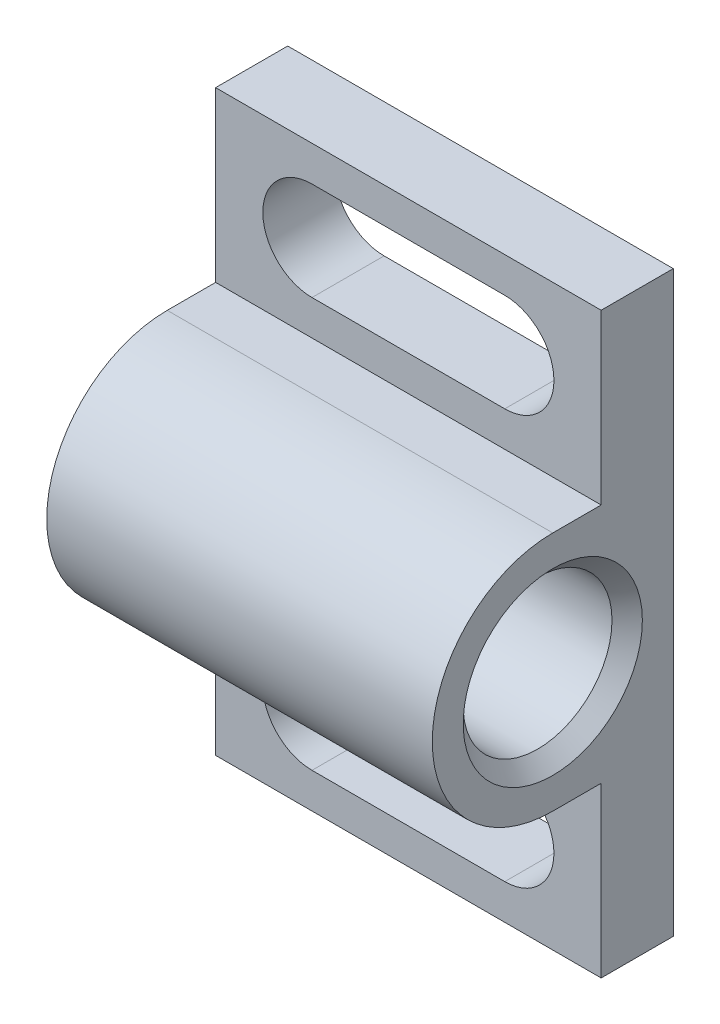
ISO-10303-21;
HEADER;
FILE_DESCRIPTION(('STEP AP214'),'2;1');
FILE_NAME('part.step','',(''),(''),'','','');
FILE_SCHEMA(('AUTOMOTIVE_DESIGN { 1 0 10303 214 1 1 1 1 }'));
ENDSEC;
DATA;
#1=APPLICATION_CONTEXT('core data for automotive mechanical design processes');
#2=APPLICATION_PROTOCOL_DEFINITION('international standard','automotive_design',2000,#1);
#3=PRODUCT_CONTEXT('',#1,'mechanical');
#4=PRODUCT('Part','Part','',(#3));
#5=PRODUCT_RELATED_PRODUCT_CATEGORY('part','',(#4));
#6=PRODUCT_DEFINITION_FORMATION('','',#4);
#7=PRODUCT_DEFINITION_CONTEXT('part definition',#1,'design');
#8=PRODUCT_DEFINITION('design','',#6,#7);
#9=PRODUCT_DEFINITION_SHAPE('','',#8);
#10=(LENGTH_UNIT() NAMED_UNIT(*) SI_UNIT(.MILLI.,.METRE.));
#11=(NAMED_UNIT(*) PLANE_ANGLE_UNIT() SI_UNIT($,.RADIAN.));
#12=(NAMED_UNIT(*) SI_UNIT($,.STERADIAN.) SOLID_ANGLE_UNIT());
#13=UNCERTAINTY_MEASURE_WITH_UNIT(LENGTH_MEASURE(1.E-05),#10,'distance_accuracy_value','');
#14=(GEOMETRIC_REPRESENTATION_CONTEXT(3) GLOBAL_UNCERTAINTY_ASSIGNED_CONTEXT((#13)) GLOBAL_UNIT_ASSIGNED_CONTEXT((#10,
#11,#12)) REPRESENTATION_CONTEXT('',''));
#15=CARTESIAN_POINT('',(0.,0.,0.));
#16=DIRECTION('',(0.,0.,1.));
#17=DIRECTION('',(1.,0.,0.));
#18=AXIS2_PLACEMENT_3D('',#15,#16,#17);
#19=CARTESIAN_POINT('',(-25.4,-19.05,0.));
#20=DIRECTION('',(0.,0.,-1.));
#21=DIRECTION('',(0.,1.,0.));
#22=AXIS2_PLACEMENT_3D('',#19,#20,#21);
#23=PLANE('',#22);
#24=DIRECTION('',(0.,1.,0.));
#25=VECTOR('',#24,1.);
#26=CARTESIAN_POINT('',(0.,-19.05,0.));
#27=LINE('',#26,#25);
#28=CARTESIAN_POINT('',(0.,-19.05,0.));
#29=VERTEX_POINT('',#28);
#30=CARTESIAN_POINT('',(0.,19.05,0.));
#31=VERTEX_POINT('',#30);
#32=EDGE_CURVE('E261',#29,#31,#27,.T.);
#33=ORIENTED_EDGE('',*,*,#32,.F.);
#34=DIRECTION('',(1.,0.,0.));
#35=VECTOR('',#34,1.);
#36=CARTESIAN_POINT('',(-25.4,-19.05,0.));
#37=LINE('',#36,#35);
#38=CARTESIAN_POINT('',(-25.4,-19.05,0.));
#39=VERTEX_POINT('',#38);
#40=EDGE_CURVE('E41',#39,#29,#37,.T.);
#41=ORIENTED_EDGE('',*,*,#40,.F.);
#42=DIRECTION('',(0.,1.,0.));
#43=VECTOR('',#42,1.);
#44=CARTESIAN_POINT('',(-25.4,-19.05,0.));
#45=LINE('',#44,#43);
#46=CARTESIAN_POINT('',(-25.4,19.05,0.));
#47=VERTEX_POINT('',#46);
#48=EDGE_CURVE('E237',#39,#47,#45,.T.);
#49=ORIENTED_EDGE('',*,*,#48,.T.);
#50=DIRECTION('',(1.,0.,0.));
#51=VECTOR('',#50,1.);
#52=CARTESIAN_POINT('',(-25.4,19.05,0.));
#53=LINE('',#52,#51);
#54=EDGE_CURVE('E289',#47,#31,#53,.T.);
#55=ORIENTED_EDGE('',*,*,#54,.T.);
#56=EDGE_LOOP('',(#33,#41,#49,#55));
#57=FACE_BOUND('',#56,.T.);
#58=DIRECTION('',(-1.,0.,0.));
#59=VECTOR('',#58,1.);
#60=CARTESIAN_POINT('',(-19.05,16.7259,0.));
#61=LINE('',#60,#59);
#62=CARTESIAN_POINT('',(-6.35,16.7259,0.));
#63=VERTEX_POINT('',#62);
#64=CARTESIAN_POINT('',(-19.05,16.7259,0.));
#65=VERTEX_POINT('',#64);
#66=EDGE_CURVE('E203',#63,#65,#61,.T.);
#67=ORIENTED_EDGE('',*,*,#66,.T.);
#68=CARTESIAN_POINT('',(-19.05,13.4874,0.));
#69=DIRECTION('',(0.,0.,1.));
#70=DIRECTION('',(1.,0.,0.));
#71=AXIS2_PLACEMENT_3D('',#68,#69,#70);
#72=CIRCLE('',#71,3.2385);
#73=CARTESIAN_POINT('',(-19.05,10.2489,0.));
#74=VERTEX_POINT('',#73);
#75=EDGE_CURVE('E194',#65,#74,#72,.T.);
#76=ORIENTED_EDGE('',*,*,#75,.T.);
#77=DIRECTION('',(1.,0.,0.));
#78=VECTOR('',#77,1.);
#79=CARTESIAN_POINT('',(-19.05,10.2489,0.));
#80=LINE('',#79,#78);
#81=CARTESIAN_POINT('',(-6.35000000000001,10.2489,0.));
#82=VERTEX_POINT('',#81);
#83=EDGE_CURVE('E197',#74,#82,#80,.T.);
#84=ORIENTED_EDGE('',*,*,#83,.T.);
#85=CARTESIAN_POINT('',(-6.35,13.4874,0.));
#86=DIRECTION('',(0.,0.,1.));
#87=DIRECTION('',(1.,0.,0.));
#88=AXIS2_PLACEMENT_3D('',#85,#86,#87);
#89=CIRCLE('',#88,3.2385);
#90=EDGE_CURVE('E200',#82,#63,#89,.T.);
#91=ORIENTED_EDGE('',*,*,#90,.T.);
#92=EDGE_LOOP('',(#67,#76,#84,#91));
#93=FACE_BOUND('',#92,.T.);
#94=DIRECTION('',(-1.,0.,0.));
#95=VECTOR('',#94,1.);
#96=CARTESIAN_POINT('',(-19.05,-10.2489,0.));
#97=LINE('',#96,#95);
#98=CARTESIAN_POINT('',(-6.35,-10.2489,0.));
#99=VERTEX_POINT('',#98);
#100=CARTESIAN_POINT('',(-19.05,-10.2489,0.));
#101=VERTEX_POINT('',#100);
#102=EDGE_CURVE('E159',#99,#101,#97,.T.);
#103=ORIENTED_EDGE('',*,*,#102,.T.);
#104=CARTESIAN_POINT('',(-19.05,-13.4874,0.));
#105=DIRECTION('',(0.,0.,1.));
#106=DIRECTION('',(-1.,0.,0.));
#107=AXIS2_PLACEMENT_3D('',#104,#105,#106);
#108=CIRCLE('',#107,3.2385);
#109=CARTESIAN_POINT('',(-19.05,-16.7259,0.));
#110=VERTEX_POINT('',#109);
#111=EDGE_CURVE('E54',#101,#110,#108,.T.);
#112=ORIENTED_EDGE('',*,*,#111,.T.);
#113=DIRECTION('',(1.,0.,0.));
#114=VECTOR('',#113,1.);
#115=CARTESIAN_POINT('',(-19.05,-16.7259,0.));
#116=LINE('',#115,#114);
#117=CARTESIAN_POINT('',(-6.35,-16.7259,0.));
#118=VERTEX_POINT('',#117);
#119=EDGE_CURVE('E172',#110,#118,#116,.T.);
#120=ORIENTED_EDGE('',*,*,#119,.T.);
#121=CARTESIAN_POINT('',(-6.35,-13.4874,0.));
#122=DIRECTION('',(0.,0.,1.));
#123=DIRECTION('',(-1.,0.,0.));
#124=AXIS2_PLACEMENT_3D('',#121,#122,#123);
#125=CIRCLE('',#124,3.2385);
#126=EDGE_CURVE('E179',#118,#99,#125,.T.);
#127=ORIENTED_EDGE('',*,*,#126,.T.);
#128=EDGE_LOOP('',(#103,#112,#120,#127));
#129=FACE_BOUND('',#128,.T.);
#130=ADVANCED_FACE('F37',(#57,#93,#129),#23,.T.);
#131=CARTESIAN_POINT('',(-25.4,-19.05,4.7498));
#132=DIRECTION('',(0.,0.,1.));
#133=DIRECTION('',(1.,0.,0.));
#134=AXIS2_PLACEMENT_3D('',#131,#132,#133);
#135=PLANE('',#134);
#136=DIRECTION('',(0.,-1.,0.));
#137=VECTOR('',#136,1.);
#138=CARTESIAN_POINT('',(0.,-19.05,4.7498));
#139=LINE('',#138,#137);
#140=CARTESIAN_POINT('',(0.,-7.9375,4.7498));
#141=VERTEX_POINT('',#140);
#142=CARTESIAN_POINT('',(0.,-19.05,4.7498));
#143=VERTEX_POINT('',#142);
#144=EDGE_CURVE('E238',#141,#143,#139,.T.);
#145=ORIENTED_EDGE('',*,*,#144,.F.);
#146=DIRECTION('',(1.,0.,0.));
#147=VECTOR('',#146,1.);
#148=CARTESIAN_POINT('',(-25.4,-7.9375,4.7498));
#149=LINE('',#148,#147);
#150=CARTESIAN_POINT('',(-25.4,-7.9375,4.7498));
#151=VERTEX_POINT('',#150);
#152=EDGE_CURVE('E46',#151,#141,#149,.T.);
#153=ORIENTED_EDGE('',*,*,#152,.F.);
#154=DIRECTION('',(0.,-1.,0.));
#155=VECTOR('',#154,1.);
#156=CARTESIAN_POINT('',(-25.4,-19.05,4.7498));
#157=LINE('',#156,#155);
#158=CARTESIAN_POINT('',(-25.4,-19.05,4.7498));
#159=VERTEX_POINT('',#158);
#160=EDGE_CURVE('E256',#151,#159,#157,.T.);
#161=ORIENTED_EDGE('',*,*,#160,.T.);
#162=DIRECTION('',(1.,0.,0.));
#163=VECTOR('',#162,1.);
#164=CARTESIAN_POINT('',(-25.4,-19.05,4.7498));
#165=LINE('',#164,#163);
#166=EDGE_CURVE('E11',#159,#143,#165,.T.);
#167=ORIENTED_EDGE('',*,*,#166,.T.);
#168=EDGE_LOOP('',(#145,#153,#161,#167));
#169=FACE_BOUND('',#168,.T.);
#170=DIRECTION('',(1.,0.,0.));
#171=VECTOR('',#170,1.);
#172=CARTESIAN_POINT('',(-19.05,-16.7259,4.7498));
#173=LINE('',#172,#171);
#174=CARTESIAN_POINT('',(-19.05,-16.7259,4.7498));
#175=VERTEX_POINT('',#174);
#176=CARTESIAN_POINT('',(-6.35,-16.7259,4.7498));
#177=VERTEX_POINT('',#176);
#178=EDGE_CURVE('E170',#175,#177,#173,.T.);
#179=ORIENTED_EDGE('',*,*,#178,.F.);
#180=CARTESIAN_POINT('',(-19.05,-13.4874,4.7498));
#181=DIRECTION('',(0.,0.,1.));
#182=DIRECTION('',(1.,0.,0.));
#183=AXIS2_PLACEMENT_3D('',#180,#181,#182);
#184=CIRCLE('',#183,3.2385);
#185=CARTESIAN_POINT('',(-19.05,-10.2489,4.7498));
#186=VERTEX_POINT('',#185);
#187=EDGE_CURVE('E153',#186,#175,#184,.T.);
#188=ORIENTED_EDGE('',*,*,#187,.F.);
#189=DIRECTION('',(-1.,0.,0.));
#190=VECTOR('',#189,1.);
#191=CARTESIAN_POINT('',(-19.05,-10.2489,4.7498));
#192=LINE('',#191,#190);
#193=CARTESIAN_POINT('',(-6.35,-10.2489,4.7498));
#194=VERTEX_POINT('',#193);
#195=EDGE_CURVE('E162',#194,#186,#192,.T.);
#196=ORIENTED_EDGE('',*,*,#195,.F.);
#197=CARTESIAN_POINT('',(-6.35,-13.4874,4.7498));
#198=DIRECTION('',(0.,0.,1.));
#199=DIRECTION('',(1.,0.,0.));
#200=AXIS2_PLACEMENT_3D('',#197,#198,#199);
#201=CIRCLE('',#200,3.2385);
#202=EDGE_CURVE('E62',#177,#194,#201,.T.);
#203=ORIENTED_EDGE('',*,*,#202,.F.);
#204=EDGE_LOOP('',(#179,#188,#196,#203));
#205=FACE_BOUND('',#204,.T.);
#206=ADVANCED_FACE('F168',(#169,#205),#135,.T.);
#207=CARTESIAN_POINT('',(-25.4,7.9375,4.7498));
#208=DIRECTION('',(0.,0.,1.));
#209=DIRECTION('',(1.,0.,0.));
#210=AXIS2_PLACEMENT_3D('',#207,#208,#209);
#211=PLANE('',#210);
#212=DIRECTION('',(0.,-1.,0.));
#213=VECTOR('',#212,1.);
#214=CARTESIAN_POINT('',(0.,7.9375,4.7498));
#215=LINE('',#214,#213);
#216=CARTESIAN_POINT('',(0.,19.05,4.7498));
#217=VERTEX_POINT('',#216);
#218=CARTESIAN_POINT('',(0.,7.9375,4.7498));
#219=VERTEX_POINT('',#218);
#220=EDGE_CURVE('E267',#217,#219,#215,.T.);
#221=ORIENTED_EDGE('',*,*,#220,.F.);
#222=DIRECTION('',(1.,0.,0.));
#223=VECTOR('',#222,1.);
#224=CARTESIAN_POINT('',(-25.4,19.05,4.7498));
#225=LINE('',#224,#223);
#226=CARTESIAN_POINT('',(-25.4,19.05,4.7498));
#227=VERTEX_POINT('',#226);
#228=EDGE_CURVE('E288',#227,#217,#225,.T.);
#229=ORIENTED_EDGE('',*,*,#228,.F.);
#230=DIRECTION('',(0.,-1.,0.));
#231=VECTOR('',#230,1.);
#232=CARTESIAN_POINT('',(-25.4,7.9375,4.7498));
#233=LINE('',#232,#231);
#234=CARTESIAN_POINT('',(-25.4,7.9375,4.7498));
#235=VERTEX_POINT('',#234);
#236=EDGE_CURVE('E244',#227,#235,#233,.T.);
#237=ORIENTED_EDGE('',*,*,#236,.T.);
#238=DIRECTION('',(1.,0.,0.));
#239=VECTOR('',#238,1.);
#240=CARTESIAN_POINT('',(-25.4,7.9375,4.7498));
#241=LINE('',#240,#239);
#242=EDGE_CURVE('E286',#235,#219,#241,.T.);
#243=ORIENTED_EDGE('',*,*,#242,.T.);
#244=EDGE_LOOP('',(#221,#229,#237,#243));
#245=FACE_BOUND('',#244,.T.);
#246=DIRECTION('',(1.,0.,0.));
#247=VECTOR('',#246,1.);
#248=CARTESIAN_POINT('',(-19.05,10.2489,4.7498));
#249=LINE('',#248,#247);
#250=CARTESIAN_POINT('',(-19.05,10.2489,4.7498));
#251=VERTEX_POINT('',#250);
#252=CARTESIAN_POINT('',(-6.35000000000001,10.2489,4.7498));
#253=VERTEX_POINT('',#252);
#254=EDGE_CURVE('E188',#251,#253,#249,.T.);
#255=ORIENTED_EDGE('',*,*,#254,.F.);
#256=CARTESIAN_POINT('',(-19.05,13.4874,4.7498));
#257=DIRECTION('',(0.,0.,1.));
#258=DIRECTION('',(1.,0.,0.));
#259=AXIS2_PLACEMENT_3D('',#256,#257,#258);
#260=CIRCLE('',#259,3.2385);
#261=CARTESIAN_POINT('',(-19.05,16.7259,4.7498));
#262=VERTEX_POINT('',#261);
#263=EDGE_CURVE('E191',#262,#251,#260,.T.);
#264=ORIENTED_EDGE('',*,*,#263,.F.);
#265=DIRECTION('',(-1.,0.,0.));
#266=VECTOR('',#265,1.);
#267=CARTESIAN_POINT('',(-19.05,16.7259,4.7498));
#268=LINE('',#267,#266);
#269=CARTESIAN_POINT('',(-6.35,16.7259,4.7498));
#270=VERTEX_POINT('',#269);
#271=EDGE_CURVE('E215',#270,#262,#268,.T.);
#272=ORIENTED_EDGE('',*,*,#271,.F.);
#273=CARTESIAN_POINT('',(-6.35,13.4874,4.7498));
#274=DIRECTION('',(0.,0.,1.));
#275=DIRECTION('',(1.,0.,0.));
#276=AXIS2_PLACEMENT_3D('',#273,#274,#275);
#277=CIRCLE('',#276,3.2385);
#278=EDGE_CURVE('E165',#253,#270,#277,.T.);
#279=ORIENTED_EDGE('',*,*,#278,.F.);
#280=EDGE_LOOP('',(#255,#264,#272,#279));
#281=FACE_BOUND('',#280,.T.);
#282=ADVANCED_FACE('F317',(#245,#281),#211,.T.);
#283=CARTESIAN_POINT('',(-25.4,0.,7.9375));
#284=DIRECTION('',(1.,0.,0.));
#285=DIRECTION('',(0.,0.,-1.));
#286=AXIS2_PLACEMENT_3D('',#283,#284,#285);
#287=PLANE('',#286);
#288=DIRECTION('',(0.,0.,-1.));
#289=VECTOR('',#288,1.);
#290=CARTESIAN_POINT('',(-25.4,-19.05,0.));
#291=LINE('',#290,#289);
#292=EDGE_CURVE('E234',#159,#39,#291,.T.);
#293=ORIENTED_EDGE('',*,*,#292,.F.);
#294=ORIENTED_EDGE('',*,*,#160,.F.);
#295=DIRECTION('',(0.,0.,-1.));
#296=VECTOR('',#295,1.);
#297=CARTESIAN_POINT('',(-25.4,-7.9375,7.9375));
#298=LINE('',#297,#296);
#299=CARTESIAN_POINT('',(-25.4,-7.9375,7.9375));
#300=VERTEX_POINT('',#299);
#301=EDGE_CURVE('E253',#300,#151,#298,.T.);
#302=ORIENTED_EDGE('',*,*,#301,.F.);
#303=CARTESIAN_POINT('',(-25.4,0.,7.9375));
#304=DIRECTION('',(1.,0.,0.));
#305=DIRECTION('',(0.,0.,-1.));
#306=AXIS2_PLACEMENT_3D('',#303,#304,#305);
#307=CIRCLE('',#306,7.9375);
#308=CARTESIAN_POINT('',(-25.4,7.9375,7.9375));
#309=VERTEX_POINT('',#308);
#310=EDGE_CURVE('E250',#309,#300,#307,.T.);
#311=ORIENTED_EDGE('',*,*,#310,.F.);
#312=DIRECTION('',(0.,0.,1.));
#313=VECTOR('',#312,1.);
#314=CARTESIAN_POINT('',(-25.4,7.9375,7.9375));
#315=LINE('',#314,#313);
#316=EDGE_CURVE('E247',#235,#309,#315,.T.);
#317=ORIENTED_EDGE('',*,*,#316,.F.);
#318=ORIENTED_EDGE('',*,*,#236,.F.);
#319=DIRECTION('',(0.,0.,1.));
#320=VECTOR('',#319,1.);
#321=CARTESIAN_POINT('',(-25.4,19.05,4.7498));
#322=LINE('',#321,#320);
#323=EDGE_CURVE('E241',#47,#227,#322,.T.);
#324=ORIENTED_EDGE('',*,*,#323,.F.);
#325=ORIENTED_EDGE('',*,*,#48,.F.);
#326=EDGE_LOOP('',(#293,#294,#302,#311,#317,#318,#324,#325));
#327=FACE_BOUND('',#326,.T.);
#328=CARTESIAN_POINT('',(-25.4,0.,7.9375));
#329=DIRECTION('',(1.,0.,0.));
#330=DIRECTION('',(0.,0.,-1.));
#331=AXIS2_PLACEMENT_3D('',#328,#329,#330);
#332=CIRCLE('',#331,2.5527);
#333=CARTESIAN_POINT('',(-25.4,0.,5.3848));
#334=VERTEX_POINT('',#333);
#335=EDGE_CURVE('E230',#334,#334,#332,.T.);
#336=ORIENTED_EDGE('',*,*,#335,.T.);
#337=EDGE_LOOP('',(#336));
#338=FACE_BOUND('',#337,.T.);
#339=ADVANCED_FACE('F306',(#327,#338),#287,.F.);
#340=CARTESIAN_POINT('',(0.,0.,7.9375));
#341=DIRECTION('',(1.,0.,0.));
#342=DIRECTION('',(0.,0.,-1.));
#343=AXIS2_PLACEMENT_3D('',#340,#341,#342);
#344=PLANE('',#343);
#345=DIRECTION('',(0.,0.,-1.));
#346=VECTOR('',#345,1.);
#347=CARTESIAN_POINT('',(0.,-19.05,0.));
#348=LINE('',#347,#346);
#349=EDGE_CURVE('E233',#143,#29,#348,.T.);
#350=ORIENTED_EDGE('',*,*,#349,.T.);
#351=ORIENTED_EDGE('',*,*,#32,.T.);
#352=DIRECTION('',(0.,0.,1.));
#353=VECTOR('',#352,1.);
#354=CARTESIAN_POINT('',(0.,19.05,4.7498));
#355=LINE('',#354,#353);
#356=EDGE_CURVE('E264',#31,#217,#355,.T.);
#357=ORIENTED_EDGE('',*,*,#356,.T.);
#358=ORIENTED_EDGE('',*,*,#220,.T.);
#359=DIRECTION('',(0.,0.,1.));
#360=VECTOR('',#359,1.);
#361=CARTESIAN_POINT('',(0.,7.9375,7.9375));
#362=LINE('',#361,#360);
#363=CARTESIAN_POINT('',(0.,7.9375,7.9375));
#364=VERTEX_POINT('',#363);
#365=EDGE_CURVE('E270',#219,#364,#362,.T.);
#366=ORIENTED_EDGE('',*,*,#365,.T.);
#367=CARTESIAN_POINT('',(0.,0.,7.9375));
#368=DIRECTION('',(1.,0.,0.));
#369=DIRECTION('',(0.,0.,-1.));
#370=AXIS2_PLACEMENT_3D('',#367,#368,#369);
#371=CIRCLE('',#370,7.9375);
#372=CARTESIAN_POINT('',(0.,-7.9375,7.9375));
#373=VERTEX_POINT('',#372);
#374=EDGE_CURVE('E273',#364,#373,#371,.T.);
#375=ORIENTED_EDGE('',*,*,#374,.T.);
#376=DIRECTION('',(0.,0.,-1.));
#377=VECTOR('',#376,1.);
#378=CARTESIAN_POINT('',(0.,-7.9375,7.9375));
#379=LINE('',#378,#377);
#380=EDGE_CURVE('E276',#373,#141,#379,.T.);
#381=ORIENTED_EDGE('',*,*,#380,.T.);
#382=ORIENTED_EDGE('',*,*,#144,.T.);
#383=EDGE_LOOP('',(#350,#351,#357,#358,#366,#375,#381,#382));
#384=FACE_BOUND('',#383,.T.);
#385=CARTESIAN_POINT('',(0.,0.,7.9375));
#386=DIRECTION('',(1.,0.,0.));
#387=DIRECTION('',(0.,0.,-1.));
#388=AXIS2_PLACEMENT_3D('',#385,#386,#387);
#389=CIRCLE('',#388,5.9022);
#390=CARTESIAN_POINT('',(0.,0.,2.0353));
#391=VERTEX_POINT('',#390);
#392=EDGE_CURVE('E218',#391,#391,#389,.T.);
#393=ORIENTED_EDGE('',*,*,#392,.F.);
#394=EDGE_LOOP('',(#393));
#395=FACE_BOUND('',#394,.T.);
#396=ADVANCED_FACE('F299',(#384,#395),#344,.T.);
#397=CARTESIAN_POINT('',(-25.4,-19.05,0.));
#398=DIRECTION('',(0.,-1.,0.));
#399=DIRECTION('',(0.,0.,-1.));
#400=AXIS2_PLACEMENT_3D('',#397,#398,#399);
#401=PLANE('',#400);
#402=ORIENTED_EDGE('',*,*,#349,.F.);
#403=ORIENTED_EDGE('',*,*,#166,.F.);
#404=ORIENTED_EDGE('',*,*,#292,.T.);
#405=ORIENTED_EDGE('',*,*,#40,.T.);
#406=EDGE_LOOP('',(#402,#403,#404,#405));
#407=FACE_BOUND('',#406,.T.);
#408=ADVANCED_FACE('F39',(#407),#401,.T.);
#409=CARTESIAN_POINT('',(-25.4,-7.9375,7.9375));
#410=DIRECTION('',(0.,-1.,0.));
#411=DIRECTION('',(0.,0.,-1.));
#412=AXIS2_PLACEMENT_3D('',#409,#410,#411);
#413=PLANE('',#412);
#414=ORIENTED_EDGE('',*,*,#380,.F.);
#415=DIRECTION('',(1.,0.,0.));
#416=VECTOR('',#415,1.);
#417=CARTESIAN_POINT('',(-25.4,-7.9375,7.9375));
#418=LINE('',#417,#416);
#419=EDGE_CURVE('E282',#300,#373,#418,.T.);
#420=ORIENTED_EDGE('',*,*,#419,.F.);
#421=ORIENTED_EDGE('',*,*,#301,.T.);
#422=ORIENTED_EDGE('',*,*,#152,.T.);
#423=EDGE_LOOP('',(#414,#420,#421,#422));
#424=FACE_BOUND('',#423,.T.);
#425=ADVANCED_FACE('F326',(#424),#413,.T.);
#426=CARTESIAN_POINT('',(-25.4,0.,7.9375));
#427=DIRECTION('',(1.,0.,0.));
#428=DIRECTION('',(0.,0.,-1.));
#429=AXIS2_PLACEMENT_3D('',#426,#427,#428);
#430=CYLINDRICAL_SURFACE('',#429,7.9375);
#431=ORIENTED_EDGE('',*,*,#374,.F.);
#432=DIRECTION('',(1.,0.,0.));
#433=VECTOR('',#432,1.);
#434=CARTESIAN_POINT('',(-25.4,7.9375,7.9375));
#435=LINE('',#434,#433);
#436=EDGE_CURVE('E284',#309,#364,#435,.T.);
#437=ORIENTED_EDGE('',*,*,#436,.F.);
#438=ORIENTED_EDGE('',*,*,#310,.T.);
#439=ORIENTED_EDGE('',*,*,#419,.T.);
#440=EDGE_LOOP('',(#431,#437,#438,#439));
#441=FACE_BOUND('',#440,.T.);
#442=ADVANCED_FACE('F324',(#441),#430,.T.);
#443=CARTESIAN_POINT('',(-25.4,7.9375,7.9375));
#444=DIRECTION('',(0.,1.,0.));
#445=DIRECTION('',(0.,0.,1.));
#446=AXIS2_PLACEMENT_3D('',#443,#444,#445);
#447=PLANE('',#446);
#448=ORIENTED_EDGE('',*,*,#365,.F.);
#449=ORIENTED_EDGE('',*,*,#242,.F.);
#450=ORIENTED_EDGE('',*,*,#316,.T.);
#451=ORIENTED_EDGE('',*,*,#436,.T.);
#452=EDGE_LOOP('',(#448,#449,#450,#451));
#453=FACE_BOUND('',#452,.T.);
#454=ADVANCED_FACE('F320',(#453),#447,.T.);
#455=CARTESIAN_POINT('',(-25.4,19.05,4.7498));
#456=DIRECTION('',(0.,1.,0.));
#457=DIRECTION('',(0.,0.,1.));
#458=AXIS2_PLACEMENT_3D('',#455,#456,#457);
#459=PLANE('',#458);
#460=ORIENTED_EDGE('',*,*,#356,.F.);
#461=ORIENTED_EDGE('',*,*,#54,.F.);
#462=ORIENTED_EDGE('',*,*,#323,.T.);
#463=ORIENTED_EDGE('',*,*,#228,.T.);
#464=EDGE_LOOP('',(#460,#461,#462,#463));
#465=FACE_BOUND('',#464,.T.);
#466=ADVANCED_FACE('F313',(#465),#459,.T.);
#467=CARTESIAN_POINT('',(0.,0.,7.9375));
#468=DIRECTION('',(1.,0.,0.));
#469=DIRECTION('',(0.,0.,-1.));
#470=AXIS2_PLACEMENT_3D('',#467,#468,#469);
#471=CYLINDRICAL_SURFACE('',#470,2.5527);
#472=CARTESIAN_POINT('',(-19.05,0.,7.9375));
#473=DIRECTION('',(1.,0.,0.));
#474=DIRECTION('',(0.,0.,-1.));
#475=AXIS2_PLACEMENT_3D('',#472,#473,#474);
#476=CIRCLE('',#475,2.5527);
#477=CARTESIAN_POINT('',(-19.05,0.,5.3848));
#478=VERTEX_POINT('',#477);
#479=EDGE_CURVE('E227',#478,#478,#476,.T.);
#480=ORIENTED_EDGE('',*,*,#479,.T.);
#481=EDGE_LOOP('',(#480));
#482=FACE_BOUND('',#481,.T.);
#483=ORIENTED_EDGE('',*,*,#335,.F.);
#484=EDGE_LOOP('',(#483));
#485=FACE_BOUND('',#484,.T.);
#486=ADVANCED_FACE('F342',(#482,#485),#471,.F.);
#487=CARTESIAN_POINT('',(-19.05,0.,5.3848));
#488=DIRECTION('',(1.,0.,0.));
#489=DIRECTION('',(0.,0.,-1.));
#490=AXIS2_PLACEMENT_3D('',#487,#488,#489);
#491=PLANE('',#490);
#492=CARTESIAN_POINT('',(-19.05,0.,7.9375));
#493=DIRECTION('',(1.,0.,0.));
#494=DIRECTION('',(0.,0.,-1.));
#495=AXIS2_PLACEMENT_3D('',#492,#493,#494);
#496=CIRCLE('',#495,4.9022);
#497=CARTESIAN_POINT('',(-19.05,0.,3.03530000000001));
#498=VERTEX_POINT('',#497);
#499=EDGE_CURVE('E224',#498,#498,#496,.T.);
#500=ORIENTED_EDGE('',*,*,#499,.T.);
#501=EDGE_LOOP('',(#500));
#502=FACE_BOUND('',#501,.T.);
#503=ORIENTED_EDGE('',*,*,#479,.F.);
#504=EDGE_LOOP('',(#503));
#505=FACE_BOUND('',#504,.T.);
#506=ADVANCED_FACE('F361',(#502,#505),#491,.T.);
#507=CARTESIAN_POINT('',(0.,0.,7.9375));
#508=DIRECTION('',(1.,0.,0.));
#509=DIRECTION('',(0.,0.,-1.));
#510=AXIS2_PLACEMENT_3D('',#507,#508,#509);
#511=CYLINDRICAL_SURFACE('',#510,4.9022);
#512=CARTESIAN_POINT('',(-0.999999999999998,0.,7.9375));
#513=DIRECTION('',(1.,0.,0.));
#514=DIRECTION('',(0.,0.,-1.));
#515=AXIS2_PLACEMENT_3D('',#512,#513,#514);
#516=CIRCLE('',#515,4.9022);
#517=CARTESIAN_POINT('',(-0.999999999999998,0.,3.0353));
#518=VERTEX_POINT('',#517);
#519=EDGE_CURVE('E221',#518,#518,#516,.T.);
#520=ORIENTED_EDGE('',*,*,#519,.T.);
#521=EDGE_LOOP('',(#520));
#522=FACE_BOUND('',#521,.T.);
#523=ORIENTED_EDGE('',*,*,#499,.F.);
#524=EDGE_LOOP('',(#523));
#525=FACE_BOUND('',#524,.T.);
#526=ADVANCED_FACE('F370',(#522,#525),#511,.F.);
#527=CARTESIAN_POINT('',(-0.999999999999998,0.,7.9375));
#528=DIRECTION('',(1.,0.,0.));
#529=DIRECTION('',(0.,0.,-1.));
#530=AXIS2_PLACEMENT_3D('',#527,#528,#529);
#531=CONICAL_SURFACE('',#530,4.9022,0.78539816339745);
#532=ORIENTED_EDGE('',*,*,#392,.T.);
#533=EDGE_LOOP('',(#532));
#534=FACE_BOUND('',#533,.T.);
#535=ORIENTED_EDGE('',*,*,#519,.F.);
#536=EDGE_LOOP('',(#535));
#537=FACE_BOUND('',#536,.T.);
#538=ADVANCED_FACE('F378',(#534,#537),#531,.F.);
#539=CARTESIAN_POINT('',(-19.05,13.4874,15.876));
#540=DIRECTION('',(0.,0.,-1.));
#541=DIRECTION('',(-1.,0.,0.));
#542=AXIS2_PLACEMENT_3D('',#539,#540,#541);
#543=CYLINDRICAL_SURFACE('',#542,3.2385);
#544=ORIENTED_EDGE('',*,*,#263,.T.);
#545=DIRECTION('',(0.,0.,-1.));
#546=VECTOR('',#545,1.);
#547=CARTESIAN_POINT('',(-19.05,10.2489,15.876));
#548=LINE('',#547,#546);
#549=EDGE_CURVE('E213',#251,#74,#548,.T.);
#550=ORIENTED_EDGE('',*,*,#549,.T.);
#551=ORIENTED_EDGE('',*,*,#75,.F.);
#552=DIRECTION('',(0.,0.,-1.));
#553=VECTOR('',#552,1.);
#554=CARTESIAN_POINT('',(-19.05,16.7259,15.876));
#555=LINE('',#554,#553);
#556=EDGE_CURVE('E206',#262,#65,#555,.T.);
#557=ORIENTED_EDGE('',*,*,#556,.F.);
#558=EDGE_LOOP('',(#544,#550,#551,#557));
#559=FACE_BOUND('',#558,.T.);
#560=ADVANCED_FACE('F386',(#559),#543,.F.);
#561=CARTESIAN_POINT('',(-19.05,10.2489,15.876));
#562=DIRECTION('',(0.,1.,0.));
#563=DIRECTION('',(-1.,0.,0.));
#564=AXIS2_PLACEMENT_3D('',#561,#562,#563);
#565=PLANE('',#564);
#566=ORIENTED_EDGE('',*,*,#254,.T.);
#567=DIRECTION('',(0.,0.,-1.));
#568=VECTOR('',#567,1.);
#569=CARTESIAN_POINT('',(-6.35000000000001,10.2489,15.876));
#570=LINE('',#569,#568);
#571=EDGE_CURVE('E211',#253,#82,#570,.T.);
#572=ORIENTED_EDGE('',*,*,#571,.T.);
#573=ORIENTED_EDGE('',*,*,#83,.F.);
#574=ORIENTED_EDGE('',*,*,#549,.F.);
#575=EDGE_LOOP('',(#566,#572,#573,#574));
#576=FACE_BOUND('',#575,.T.);
#577=ADVANCED_FACE('F394',(#576),#565,.T.);
#578=CARTESIAN_POINT('',(-6.35,13.4874,15.876));
#579=DIRECTION('',(0.,0.,-1.));
#580=DIRECTION('',(-1.,0.,0.));
#581=AXIS2_PLACEMENT_3D('',#578,#579,#580);
#582=CYLINDRICAL_SURFACE('',#581,3.2385);
#583=ORIENTED_EDGE('',*,*,#278,.T.);
#584=DIRECTION('',(0.,0.,-1.));
#585=VECTOR('',#584,1.);
#586=CARTESIAN_POINT('',(-6.35,16.7259,15.876));
#587=LINE('',#586,#585);
#588=EDGE_CURVE('E209',#270,#63,#587,.T.);
#589=ORIENTED_EDGE('',*,*,#588,.T.);
#590=ORIENTED_EDGE('',*,*,#90,.F.);
#591=ORIENTED_EDGE('',*,*,#571,.F.);
#592=EDGE_LOOP('',(#583,#589,#590,#591));
#593=FACE_BOUND('',#592,.T.);
#594=ADVANCED_FACE('F403',(#593),#582,.F.);
#595=CARTESIAN_POINT('',(-19.05,16.7259,15.876));
#596=DIRECTION('',(0.,-1.,0.));
#597=DIRECTION('',(0.,0.,-1.));
#598=AXIS2_PLACEMENT_3D('',#595,#596,#597);
#599=PLANE('',#598);
#600=ORIENTED_EDGE('',*,*,#271,.T.);
#601=ORIENTED_EDGE('',*,*,#556,.T.);
#602=ORIENTED_EDGE('',*,*,#66,.F.);
#603=ORIENTED_EDGE('',*,*,#588,.F.);
#604=EDGE_LOOP('',(#600,#601,#602,#603));
#605=FACE_BOUND('',#604,.T.);
#606=ADVANCED_FACE('F411',(#605),#599,.T.);
#607=CARTESIAN_POINT('',(-19.05,-13.4874,15.876));
#608=DIRECTION('',(0.,0.,-1.));
#609=DIRECTION('',(-1.,0.,0.));
#610=AXIS2_PLACEMENT_3D('',#607,#608,#609);
#611=CYLINDRICAL_SURFACE('',#610,3.2385);
#612=ORIENTED_EDGE('',*,*,#187,.T.);
#613=DIRECTION('',(0.,0.,-1.));
#614=VECTOR('',#613,1.);
#615=CARTESIAN_POINT('',(-19.05,-16.7259,15.876));
#616=LINE('',#615,#614);
#617=EDGE_CURVE('E166',#175,#110,#616,.T.);
#618=ORIENTED_EDGE('',*,*,#617,.T.);
#619=ORIENTED_EDGE('',*,*,#111,.F.);
#620=DIRECTION('',(0.,0.,-1.));
#621=VECTOR('',#620,1.);
#622=CARTESIAN_POINT('',(-19.05,-10.2489,15.876));
#623=LINE('',#622,#621);
#624=EDGE_CURVE('E149',#186,#101,#623,.T.);
#625=ORIENTED_EDGE('',*,*,#624,.F.);
#626=EDGE_LOOP('',(#612,#618,#619,#625));
#627=FACE_BOUND('',#626,.T.);
#628=ADVANCED_FACE('F151',(#627),#611,.F.);
#629=CARTESIAN_POINT('',(-19.05,-16.7259,15.876));
#630=DIRECTION('',(0.,1.,0.));
#631=DIRECTION('',(0.,0.,1.));
#632=AXIS2_PLACEMENT_3D('',#629,#630,#631);
#633=PLANE('',#632);
#634=ORIENTED_EDGE('',*,*,#178,.T.);
#635=DIRECTION('',(0.,0.,-1.));
#636=VECTOR('',#635,1.);
#637=CARTESIAN_POINT('',(-6.35,-16.7259,15.876));
#638=LINE('',#637,#636);
#639=EDGE_CURVE('E184',#177,#118,#638,.T.);
#640=ORIENTED_EDGE('',*,*,#639,.T.);
#641=ORIENTED_EDGE('',*,*,#119,.F.);
#642=ORIENTED_EDGE('',*,*,#617,.F.);
#643=EDGE_LOOP('',(#634,#640,#641,#642));
#644=FACE_BOUND('',#643,.T.);
#645=ADVANCED_FACE('F426',(#644),#633,.T.);
#646=CARTESIAN_POINT('',(-6.35,-13.4874,15.876));
#647=DIRECTION('',(0.,0.,-1.));
#648=DIRECTION('',(-1.,0.,0.));
#649=AXIS2_PLACEMENT_3D('',#646,#647,#648);
#650=CYLINDRICAL_SURFACE('',#649,3.2385);
#651=ORIENTED_EDGE('',*,*,#202,.T.);
#652=DIRECTION('',(0.,0.,-1.));
#653=VECTOR('',#652,1.);
#654=CARTESIAN_POINT('',(-6.35,-10.2489,15.876));
#655=LINE('',#654,#653);
#656=EDGE_CURVE('E158',#194,#99,#655,.T.);
#657=ORIENTED_EDGE('',*,*,#656,.T.);
#658=ORIENTED_EDGE('',*,*,#126,.F.);
#659=ORIENTED_EDGE('',*,*,#639,.F.);
#660=EDGE_LOOP('',(#651,#657,#658,#659));
#661=FACE_BOUND('',#660,.T.);
#662=ADVANCED_FACE('F433',(#661),#650,.F.);
#663=CARTESIAN_POINT('',(-19.05,-10.2489,15.876));
#664=DIRECTION('',(0.,-1.,0.));
#665=DIRECTION('',(1.,0.,0.));
#666=AXIS2_PLACEMENT_3D('',#663,#664,#665);
#667=PLANE('',#666);
#668=ORIENTED_EDGE('',*,*,#195,.T.);
#669=ORIENTED_EDGE('',*,*,#624,.T.);
#670=ORIENTED_EDGE('',*,*,#102,.F.);
#671=ORIENTED_EDGE('',*,*,#656,.F.);
#672=EDGE_LOOP('',(#668,#669,#670,#671));
#673=FACE_BOUND('',#672,.T.);
#674=ADVANCED_FACE('F163',(#673),#667,.T.);
#675=CLOSED_SHELL('',(#130,#206,#282,#339,#396,#408,#425,#442,#454,#466,#486,#506,#526,#538,
#560,#577,#594,#606,#628,#645,#662,#674));
#676=MANIFOLD_SOLID_BREP('B2',#675);
#677=ADVANCED_BREP_SHAPE_REPRESENTATION('',(#18,#676),#14);
#678=SHAPE_DEFINITION_REPRESENTATION(#9,#677);
ENDSEC;
END-ISO-10303-21;
